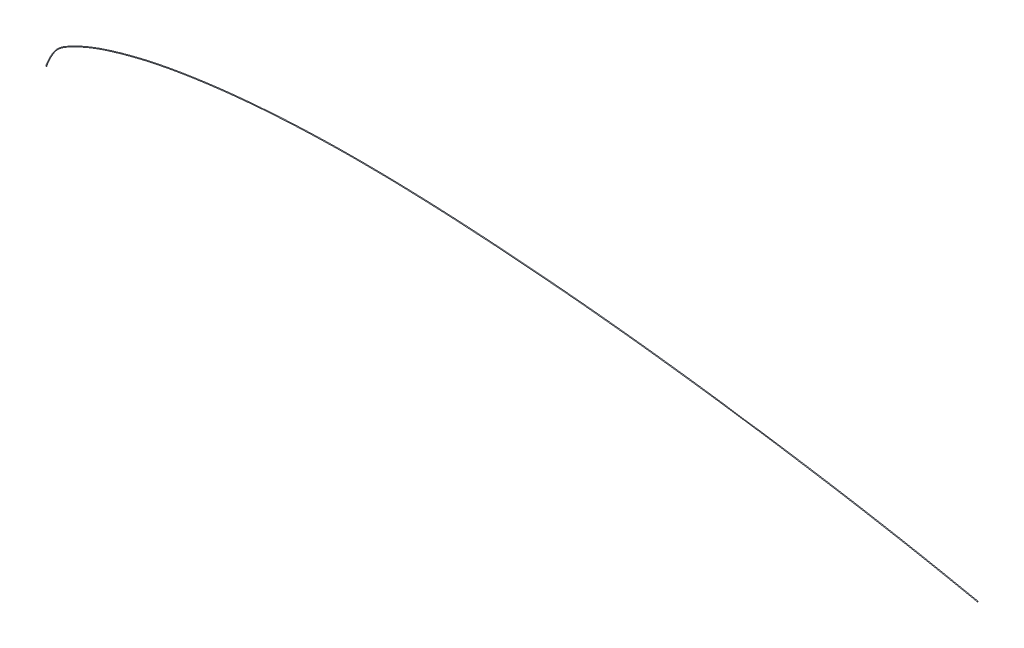
ISO-10303-21;
HEADER;
FILE_DESCRIPTION(('STEP AP214'),'2;1');
FILE_NAME('part.step','',(''),(''),'','','');
FILE_SCHEMA(('AUTOMOTIVE_DESIGN { 1 0 10303 214 1 1 1 1 }'));
ENDSEC;
DATA;
#1=APPLICATION_CONTEXT('core data for automotive mechanical design processes');
#2=APPLICATION_PROTOCOL_DEFINITION('international standard','automotive_design',2000,#1);
#3=PRODUCT_CONTEXT('',#1,'mechanical');
#4=PRODUCT('Part','Part','',(#3));
#5=PRODUCT_RELATED_PRODUCT_CATEGORY('part','',(#4));
#6=PRODUCT_DEFINITION_FORMATION('','',#4);
#7=PRODUCT_DEFINITION_CONTEXT('part definition',#1,'design');
#8=PRODUCT_DEFINITION('design','',#6,#7);
#9=PRODUCT_DEFINITION_SHAPE('','',#8);
#10=(LENGTH_UNIT() NAMED_UNIT(*) SI_UNIT(.MILLI.,.METRE.));
#11=(NAMED_UNIT(*) PLANE_ANGLE_UNIT() SI_UNIT($,.RADIAN.));
#12=(NAMED_UNIT(*) SI_UNIT($,.STERADIAN.) SOLID_ANGLE_UNIT());
#13=UNCERTAINTY_MEASURE_WITH_UNIT(LENGTH_MEASURE(1.E-05),#10,'distance_accuracy_value','');
#14=(GEOMETRIC_REPRESENTATION_CONTEXT(3) GLOBAL_UNCERTAINTY_ASSIGNED_CONTEXT((#13)) GLOBAL_UNIT_ASSIGNED_CONTEXT((#10,
#11,#12)) REPRESENTATION_CONTEXT('',''));
#15=CARTESIAN_POINT('',(0.,0.,0.));
#16=DIRECTION('',(0.,0.,1.));
#17=DIRECTION('',(1.,0.,0.));
#18=AXIS2_PLACEMENT_3D('',#15,#16,#17);
#19=CARTESIAN_POINT('',(1304.66,1.696058,0.));
#20=DIRECTION('',(0.98101772640487,0.193918076721638,0.));
#21=DIRECTION('',(0.,0.,1.));
#22=AXIS2_PLACEMENT_3D('',#19,#20,#21);
#23=PLANE('',#22);
#24=CARTESIAN_POINT('',(1304.66,1.696058,0.));
#25=DIRECTION('',(0.98101772640487,0.193918076721638,0.));
#26=DIRECTION('',(0.,0.,1.));
#27=AXIS2_PLACEMENT_3D('',#24,#25,#26);
#28=CIRCLE('',#27,0.5);
#29=CARTESIAN_POINT('',(1304.66,1.696058,0.5));
#30=VERTEX_POINT('',#29);
#31=EDGE_CURVE('E10',#30,#30,#28,.T.);
#32=ORIENTED_EDGE('',*,*,#31,.T.);
#33=EDGE_LOOP('',(#32));
#34=FACE_BOUND('',#33,.T.);
#35=ADVANCED_FACE('F36',(#34),#23,.T.);
#36=CARTESIAN_POINT('',(1304.66,1.696058,0.5));
#37=CARTESIAN_POINT('',(1282.92772693694,6.14929782340755,0.5));
#38=CARTESIAN_POINT('',(1261.195453882,10.6025376463355,0.5));
#39=CARTESIAN_POINT('',(1206.93838618714,21.2468164795281,0.5));
#40=CARTESIAN_POINT('',(1174.37031889667,27.2178116733628,0.5));
#41=CARTESIAN_POINT('',(1109.1263992094,38.5316321126376,0.5));
#42=CARTESIAN_POINT('',(1076.44825562522,43.8660900637924,0.5));
#43=CARTESIAN_POINT('',(1000.31155481095,55.6370762839409,0.5));
#44=CARTESIAN_POINT('',(956.820964703096,61.8638164249425,0.5));
#45=CARTESIAN_POINT('',(869.842521959019,73.2806504857611,0.5));
#46=CARTESIAN_POINT('',(826.355106530212,78.4740001523558,0.5));
#47=CARTESIAN_POINT('',(739.3698456084,87.4650095892404,0.5));
#48=CARTESIAN_POINT('',(695.872437072038,91.2668809355757,0.5));
#49=CARTESIAN_POINT('',(608.887227843404,97.6405842757081,0.5));
#50=CARTESIAN_POINT('',(565.399633056471,100.215211806732,0.5));
#51=CARTESIAN_POINT('',(478.395079739289,103.309375670061,0.5));
#52=CARTESIAN_POINT('',(434.878268327016,103.83205512042,0.5));
#53=CARTESIAN_POINT('',(347.826991695691,101.780222102428,0.5));
#54=CARTESIAN_POINT('',(304.279102157574,99.2352342375905,0.5));
#55=CARTESIAN_POINT('',(239.007528356002,92.4337100888985,0.5));
#56=CARTESIAN_POINT('',(217.137883231133,89.6354637061965,0.5));
#57=CARTESIAN_POINT('',(173.5760451149,82.7322944815344,0.5));
#58=CARTESIAN_POINT('',(151.884626005489,78.6259584178591,0.5));
#59=CARTESIAN_POINT('',(119.431730282466,70.7870655388134,0.5));
#60=CARTESIAN_POINT('',(108.469841313403,67.8385442853681,0.5));
#61=CARTESIAN_POINT('',(86.6531895763216,61.4142545774094,0.5));
#62=CARTESIAN_POINT('',(75.800572724708,57.9356519815337,0.5));
#63=CARTESIAN_POINT('',(58.4131300467896,51.2666959353052,0.5));
#64=CARTESIAN_POINT('',(51.711977333901,48.4116238929897,0.5));
#65=CARTESIAN_POINT('',(41.7677494726042,43.7114014230806,0.5));
#66=CARTESIAN_POINT('',(38.4709237202427,42.0750581987962,0.5));
#67=CARTESIAN_POINT('',(31.9013435093909,38.653392041473,0.5));
#68=CARTESIAN_POINT('',(28.5984661307997,36.8885624123483,0.5));
#69=CARTESIAN_POINT('',(22.2960932132934,33.0021250024146,0.5));
#70=CARTESIAN_POINT('',(19.3072364724937,30.8732794068314,0.5));
#71=CARTESIAN_POINT('',(14.0650864369098,25.9470099814017,0.5));
#72=CARTESIAN_POINT('',(11.8264044231569,23.1380015646142,0.5));
#73=CARTESIAN_POINT('',(5.88042116155558,14.0150452066754,0.5));
#74=CARTESIAN_POINT('',(2.94021057981981,7.00752260419467,0.5));
#75=CARTESIAN_POINT('',(0.,0.,0.5));
#76=CARTESIAN_POINT('',(1304.85391807672,0.71504027359513,0.5));
#77=CARTESIAN_POINT('',(1283.1216450112,5.16828009701831,0.5));
#78=CARTESIAN_POINT('',(1261.39211909736,9.62205097838318,0.5));
#79=CARTESIAN_POINT('',(1207.14871082492,20.2691492072442,0.5));
#80=CARTESIAN_POINT('',(1174.58755684666,26.2416707466145,0.5));
#81=CARTESIAN_POINT('',(1109.35648443649,37.5584393134051,0.5));
#82=CARTESIAN_POINT('',(1076.68427507403,42.8943254938844,0.5));
#83=CARTESIAN_POINT('',(1000.56025923444,54.6684681733289,0.5));
#84=CARTESIAN_POINT('',(957.077048031174,60.8971302794565,0.5));
#85=CARTESIAN_POINT('',(870.113621413838,72.3180677764635,0.5));
#86=CARTESIAN_POINT('',(826.635030147962,77.5139196283311,0.5));
#87=CARTESIAN_POINT('',(739.669980471018,86.5110545440057,0.5));
#88=CARTESIAN_POINT('',(696.182045583137,90.3159707432014,0.5));
#89=CARTESIAN_POINT('',(609.21456273342,96.6956297302292,0.5));
#90=CARTESIAN_POINT('',(565.738812751709,99.2743588163506,0.5));
#91=CARTESIAN_POINT('',(478.763648082635,102.379642465031,0.5));
#92=CARTESIAN_POINT('',(435.265134839953,102.909614172309,0.5));
#93=CARTESIAN_POINT('',(348.257218143032,100.877188017373,0.5));
#94=CARTESIAN_POINT('',(304.732401335284,98.3433407876192,0.5));
#95=CARTESIAN_POINT('',(239.501620102466,91.5641599649611,0.5));
#96=CARTESIAN_POINT('',(217.647362295906,88.7747488836073,0.5));
#97=CARTESIAN_POINT('',(174.119486365586,81.8926097012969,0.5));
#98=CARTESIAN_POINT('',(152.450377648477,77.8007095587956,0.5));
#99=CARTESIAN_POINT('',(120.038154950003,69.9917392674306,0.5));
#100=CARTESIAN_POINT('',(109.089130187921,67.0532199258716,0.5));
#101=CARTESIAN_POINT('',(87.2971444218757,60.6490257118598,0.5));
#102=CARTESIAN_POINT('',(76.4648666324215,57.1872347828332,0.5));
#103=CARTESIAN_POINT('',(59.12213099632,50.5610707814937,0.5));
#104=CARTESIAN_POINT('',(52.4386672790084,47.7241789003536,0.5));
#105=CARTESIAN_POINT('',(42.5201732156656,43.052597025368,0.5));
#106=CARTESIAN_POINT('',(39.2317929793971,41.4260249191439,0.5));
#107=CARTESIAN_POINT('',(32.6786929545262,38.0241909068752,0.5));
#108=CARTESIAN_POINT('',(29.3863151815706,36.2711388312426,0.5));
#109=CARTESIAN_POINT('',(23.1349025019732,32.4559409835558,0.5));
#110=CARTESIAN_POINT('',(20.1832806038605,30.3823821131525,0.5));
#111=CARTESIAN_POINT('',(15.0158859986617,25.6238789457748,0.5));
#112=CARTESIAN_POINT('',(12.7989611667208,22.8970651692601,0.5));
#113=CARTESIAN_POINT('',(6.88665507478732,13.9588208663837,0.5));
#114=CARTESIAN_POINT('',(3.94021057981981,7.00752260419594,0.5));
#115=CARTESIAN_POINT('',(1.,0.,0.5));
#116=CARTESIAN_POINT('',(1304.85391807672,0.71504027359513,-0.5));
#117=CARTESIAN_POINT('',(1283.1216450112,5.16828009701831,-0.5));
#118=CARTESIAN_POINT('',(1261.39211909736,9.62205097838318,-0.5));
#119=CARTESIAN_POINT('',(1207.14871082492,20.2691492072442,-0.5));
#120=CARTESIAN_POINT('',(1174.58755684666,26.2416707466145,-0.5));
#121=CARTESIAN_POINT('',(1109.35648443649,37.5584393134051,-0.5));
#122=CARTESIAN_POINT('',(1076.68427507403,42.8943254938844,-0.5));
#123=CARTESIAN_POINT('',(1000.56025923444,54.6684681733289,-0.5));
#124=CARTESIAN_POINT('',(957.077048031174,60.8971302794565,-0.5));
#125=CARTESIAN_POINT('',(870.113621413838,72.3180677764635,-0.5));
#126=CARTESIAN_POINT('',(826.635030147962,77.5139196283311,-0.5));
#127=CARTESIAN_POINT('',(739.669980471018,86.5110545440057,-0.5));
#128=CARTESIAN_POINT('',(696.182045583137,90.3159707432014,-0.5));
#129=CARTESIAN_POINT('',(609.21456273342,96.6956297302292,-0.5));
#130=CARTESIAN_POINT('',(565.738812751709,99.2743588163506,-0.5));
#131=CARTESIAN_POINT('',(478.763648082635,102.379642465031,-0.5));
#132=CARTESIAN_POINT('',(435.265134839953,102.909614172309,-0.5));
#133=CARTESIAN_POINT('',(348.257218143032,100.877188017373,-0.5));
#134=CARTESIAN_POINT('',(304.732401335284,98.3433407876192,-0.5));
#135=CARTESIAN_POINT('',(239.501620102466,91.5641599649611,-0.5));
#136=CARTESIAN_POINT('',(217.647362295906,88.7747488836073,-0.5));
#137=CARTESIAN_POINT('',(174.119486365586,81.8926097012969,-0.5));
#138=CARTESIAN_POINT('',(152.450377648477,77.8007095587956,-0.5));
#139=CARTESIAN_POINT('',(120.038154950003,69.9917392674306,-0.5));
#140=CARTESIAN_POINT('',(109.089130187921,67.0532199258716,-0.5));
#141=CARTESIAN_POINT('',(87.2971444218757,60.6490257118598,-0.5));
#142=CARTESIAN_POINT('',(76.4648666324215,57.1872347828332,-0.5));
#143=CARTESIAN_POINT('',(59.12213099632,50.5610707814937,-0.5));
#144=CARTESIAN_POINT('',(52.4386672790084,47.7241789003536,-0.5));
#145=CARTESIAN_POINT('',(42.5201732156656,43.052597025368,-0.5));
#146=CARTESIAN_POINT('',(39.2317929793971,41.4260249191439,-0.5));
#147=CARTESIAN_POINT('',(32.6786929545262,38.0241909068752,-0.5));
#148=CARTESIAN_POINT('',(29.3863151815706,36.2711388312426,-0.5));
#149=CARTESIAN_POINT('',(23.1349025019732,32.4559409835558,-0.5));
#150=CARTESIAN_POINT('',(20.1832806038605,30.3823821131525,-0.5));
#151=CARTESIAN_POINT('',(15.0158859986617,25.6238789457748,-0.5));
#152=CARTESIAN_POINT('',(12.7989611667208,22.8970651692601,-0.5));
#153=CARTESIAN_POINT('',(6.88665507478732,13.9588208663837,-0.5));
#154=CARTESIAN_POINT('',(3.94021057981981,7.00752260419594,-0.5));
#155=CARTESIAN_POINT('',(1.,0.,-0.5));
#156=CARTESIAN_POINT('',(1304.66,1.696058,-0.5));
#157=CARTESIAN_POINT('',(1282.92772693694,6.14929782340755,-0.5));
#158=CARTESIAN_POINT('',(1261.195453882,10.6025376463355,-0.5));
#159=CARTESIAN_POINT('',(1206.93838618714,21.2468164795281,-0.5));
#160=CARTESIAN_POINT('',(1174.37031889667,27.2178116733628,-0.5));
#161=CARTESIAN_POINT('',(1109.1263992094,38.5316321126376,-0.5));
#162=CARTESIAN_POINT('',(1076.44825562522,43.8660900637924,-0.5));
#163=CARTESIAN_POINT('',(1000.31155481095,55.6370762839409,-0.5));
#164=CARTESIAN_POINT('',(956.820964703096,61.8638164249425,-0.5));
#165=CARTESIAN_POINT('',(869.842521959019,73.2806504857611,-0.5));
#166=CARTESIAN_POINT('',(826.355106530212,78.4740001523558,-0.5));
#167=CARTESIAN_POINT('',(739.3698456084,87.4650095892404,-0.5));
#168=CARTESIAN_POINT('',(695.872437072038,91.2668809355757,-0.5));
#169=CARTESIAN_POINT('',(608.887227843404,97.6405842757081,-0.5));
#170=CARTESIAN_POINT('',(565.399633056471,100.215211806732,-0.5));
#171=CARTESIAN_POINT('',(478.395079739289,103.309375670061,-0.5));
#172=CARTESIAN_POINT('',(434.878268327016,103.83205512042,-0.5));
#173=CARTESIAN_POINT('',(347.826991695691,101.780222102428,-0.5));
#174=CARTESIAN_POINT('',(304.279102157574,99.2352342375905,-0.5));
#175=CARTESIAN_POINT('',(239.007528356002,92.4337100888985,-0.5));
#176=CARTESIAN_POINT('',(217.137883231133,89.6354637061965,-0.5));
#177=CARTESIAN_POINT('',(173.5760451149,82.7322944815344,-0.5));
#178=CARTESIAN_POINT('',(151.884626005489,78.6259584178591,-0.5));
#179=CARTESIAN_POINT('',(119.431730282466,70.7870655388134,-0.5));
#180=CARTESIAN_POINT('',(108.469841313403,67.8385442853681,-0.5));
#181=CARTESIAN_POINT('',(86.6531895763216,61.4142545774094,-0.5));
#182=CARTESIAN_POINT('',(75.800572724708,57.9356519815337,-0.5));
#183=CARTESIAN_POINT('',(58.4131300467896,51.2666959353052,-0.5));
#184=CARTESIAN_POINT('',(51.711977333901,48.4116238929897,-0.5));
#185=CARTESIAN_POINT('',(41.7677494726042,43.7114014230806,-0.5));
#186=CARTESIAN_POINT('',(38.4709237202427,42.0750581987962,-0.5));
#187=CARTESIAN_POINT('',(31.9013435093909,38.653392041473,-0.5));
#188=CARTESIAN_POINT('',(28.5984661307997,36.8885624123483,-0.5));
#189=CARTESIAN_POINT('',(22.2960932132934,33.0021250024146,-0.5));
#190=CARTESIAN_POINT('',(19.3072364724937,30.8732794068314,-0.5));
#191=CARTESIAN_POINT('',(14.0650864369098,25.9470099814017,-0.5));
#192=CARTESIAN_POINT('',(11.8264044231569,23.1380015646142,-0.5));
#193=CARTESIAN_POINT('',(5.88042116155558,14.0150452066754,-0.5));
#194=CARTESIAN_POINT('',(2.94021057981981,7.00752260419467,-0.5));
#195=CARTESIAN_POINT('',(0.,0.,-0.5));
#196=CARTESIAN_POINT('',(1304.46608192328,2.67707572640487,-0.5));
#197=CARTESIAN_POINT('',(1282.73380886268,7.13031554979678,-0.5));
#198=CARTESIAN_POINT('',(1260.99878866664,11.5830243142878,-0.5));
#199=CARTESIAN_POINT('',(1206.72806154937,22.2244837518121,-0.5));
#200=CARTESIAN_POINT('',(1174.15308094667,28.1939526001111,-0.5));
#201=CARTESIAN_POINT('',(1108.89631398231,39.5048249118702,-0.5));
#202=CARTESIAN_POINT('',(1076.2122361764,44.8378546337004,-0.5));
#203=CARTESIAN_POINT('',(1000.06285038746,56.605684394553,-0.5));
#204=CARTESIAN_POINT('',(956.564881375017,62.8305025704285,-0.5));
#205=CARTESIAN_POINT('',(869.5714225042,74.2432331950586,-0.5));
#206=CARTESIAN_POINT('',(826.075182912462,79.4340806763805,-0.5));
#207=CARTESIAN_POINT('',(739.069710745781,88.4189646344751,-0.5));
#208=CARTESIAN_POINT('',(695.562828560939,92.21779112795,-0.5));
#209=CARTESIAN_POINT('',(608.559892953388,98.5855388211869,-0.5));
#210=CARTESIAN_POINT('',(565.060453361233,101.156064797113,-0.5));
#211=CARTESIAN_POINT('',(478.026511395943,104.239108875092,-0.5));
#212=CARTESIAN_POINT('',(434.491401814078,104.754496068532,-0.5));
#213=CARTESIAN_POINT('',(347.39676524835,102.683256187484,-0.5));
#214=CARTESIAN_POINT('',(303.825802979864,100.127127687562,-0.5));
#215=CARTESIAN_POINT('',(238.513436609538,93.3032602128359,-0.5));
#216=CARTESIAN_POINT('',(216.62840416636,90.4961785287856,-0.5));
#217=CARTESIAN_POINT('',(173.032603864213,83.5719792617719,-0.5));
#218=CARTESIAN_POINT('',(151.3188743625,79.4512072769225,-0.5));
#219=CARTESIAN_POINT('',(118.825305614928,71.5823918101961,-0.5));
#220=CARTESIAN_POINT('',(107.850552438886,68.6238686448646,-0.5));
#221=CARTESIAN_POINT('',(86.0092347307675,62.1794834429589,-0.5));
#222=CARTESIAN_POINT('',(75.1362788169945,58.6840691802343,-0.5));
#223=CARTESIAN_POINT('',(57.7041290972591,51.9723210891166,-0.5));
#224=CARTESIAN_POINT('',(50.9852873887935,49.0990688856258,-0.5));
#225=CARTESIAN_POINT('',(41.0153257295429,44.3702058207931,-0.5));
#226=CARTESIAN_POINT('',(37.7100544610884,42.7240914784485,-0.5));
#227=CARTESIAN_POINT('',(31.1239940642555,39.2825931760708,-0.5));
#228=CARTESIAN_POINT('',(27.8106170800288,37.5059859934541,-0.5));
#229=CARTESIAN_POINT('',(21.4572839246135,33.5483090212734,-0.5));
#230=CARTESIAN_POINT('',(18.431192341127,31.3641767005103,-0.5));
#231=CARTESIAN_POINT('',(13.1142868751578,26.2701410170286,-0.5));
#232=CARTESIAN_POINT('',(10.8538476795929,23.3789379599684,-0.5));
#233=CARTESIAN_POINT('',(4.87418724832385,14.0712695469671,-0.5));
#234=CARTESIAN_POINT('',(1.94021057981981,7.00752260419341,-0.5));
#235=CARTESIAN_POINT('',(-1.,0.,-0.5));
#236=CARTESIAN_POINT('',(1304.46608192328,2.67707572640487,0.5));
#237=CARTESIAN_POINT('',(1282.73380886268,7.13031554979678,0.5));
#238=CARTESIAN_POINT('',(1260.99878866664,11.5830243142878,0.5));
#239=CARTESIAN_POINT('',(1206.72806154937,22.2244837518121,0.5));
#240=CARTESIAN_POINT('',(1174.15308094667,28.1939526001111,0.5));
#241=CARTESIAN_POINT('',(1108.89631398231,39.5048249118702,0.5));
#242=CARTESIAN_POINT('',(1076.2122361764,44.8378546337004,0.5));
#243=CARTESIAN_POINT('',(1000.06285038746,56.605684394553,0.5));
#244=CARTESIAN_POINT('',(956.564881375017,62.8305025704285,0.5));
#245=CARTESIAN_POINT('',(869.5714225042,74.2432331950586,0.5));
#246=CARTESIAN_POINT('',(826.075182912462,79.4340806763805,0.5));
#247=CARTESIAN_POINT('',(739.069710745781,88.4189646344751,0.5));
#248=CARTESIAN_POINT('',(695.562828560939,92.21779112795,0.5));
#249=CARTESIAN_POINT('',(608.559892953388,98.5855388211869,0.5));
#250=CARTESIAN_POINT('',(565.060453361233,101.156064797113,0.5));
#251=CARTESIAN_POINT('',(478.026511395943,104.239108875092,0.5));
#252=CARTESIAN_POINT('',(434.491401814078,104.754496068532,0.5));
#253=CARTESIAN_POINT('',(347.39676524835,102.683256187484,0.5));
#254=CARTESIAN_POINT('',(303.825802979864,100.127127687562,0.5));
#255=CARTESIAN_POINT('',(238.513436609538,93.3032602128359,0.5));
#256=CARTESIAN_POINT('',(216.62840416636,90.4961785287856,0.5));
#257=CARTESIAN_POINT('',(173.032603864213,83.5719792617719,0.5));
#258=CARTESIAN_POINT('',(151.3188743625,79.4512072769225,0.5));
#259=CARTESIAN_POINT('',(118.825305614928,71.5823918101961,0.5));
#260=CARTESIAN_POINT('',(107.850552438886,68.6238686448646,0.5));
#261=CARTESIAN_POINT('',(86.0092347307675,62.1794834429589,0.5));
#262=CARTESIAN_POINT('',(75.1362788169945,58.6840691802343,0.5));
#263=CARTESIAN_POINT('',(57.7041290972591,51.9723210891166,0.5));
#264=CARTESIAN_POINT('',(50.9852873887935,49.0990688856258,0.5));
#265=CARTESIAN_POINT('',(41.0153257295429,44.3702058207931,0.5));
#266=CARTESIAN_POINT('',(37.7100544610884,42.7240914784485,0.5));
#267=CARTESIAN_POINT('',(31.1239940642555,39.2825931760708,0.5));
#268=CARTESIAN_POINT('',(27.8106170800288,37.5059859934541,0.5));
#269=CARTESIAN_POINT('',(21.4572839246135,33.5483090212734,0.5));
#270=CARTESIAN_POINT('',(18.431192341127,31.3641767005103,0.5));
#271=CARTESIAN_POINT('',(13.1142868751578,26.2701410170286,0.5));
#272=CARTESIAN_POINT('',(10.8538476795929,23.3789379599684,0.5));
#273=CARTESIAN_POINT('',(4.87418724832385,14.0712695469671,0.5));
#274=CARTESIAN_POINT('',(1.94021057981981,7.00752260419341,0.5));
#275=CARTESIAN_POINT('',(-1.,0.,0.5));
#276=CARTESIAN_POINT('',(1304.66,1.696058,0.5));
#277=CARTESIAN_POINT('',(1282.92772693694,6.14929782340755,0.5));
#278=CARTESIAN_POINT('',(1261.195453882,10.6025376463355,0.5));
#279=CARTESIAN_POINT('',(1206.93838618714,21.2468164795281,0.5));
#280=CARTESIAN_POINT('',(1174.37031889667,27.2178116733628,0.5));
#281=CARTESIAN_POINT('',(1109.1263992094,38.5316321126376,0.5));
#282=CARTESIAN_POINT('',(1076.44825562522,43.8660900637924,0.5));
#283=CARTESIAN_POINT('',(1000.31155481095,55.6370762839409,0.5));
#284=CARTESIAN_POINT('',(956.820964703096,61.8638164249425,0.5));
#285=CARTESIAN_POINT('',(869.842521959019,73.2806504857611,0.5));
#286=CARTESIAN_POINT('',(826.355106530212,78.4740001523558,0.5));
#287=CARTESIAN_POINT('',(739.3698456084,87.4650095892404,0.5));
#288=CARTESIAN_POINT('',(695.872437072038,91.2668809355757,0.5));
#289=CARTESIAN_POINT('',(608.887227843404,97.6405842757081,0.5));
#290=CARTESIAN_POINT('',(565.399633056471,100.215211806732,0.5));
#291=CARTESIAN_POINT('',(478.395079739289,103.309375670061,0.5));
#292=CARTESIAN_POINT('',(434.878268327016,103.83205512042,0.5));
#293=CARTESIAN_POINT('',(347.826991695691,101.780222102428,0.5));
#294=CARTESIAN_POINT('',(304.279102157574,99.2352342375905,0.5));
#295=CARTESIAN_POINT('',(239.007528356002,92.4337100888985,0.5));
#296=CARTESIAN_POINT('',(217.137883231133,89.6354637061965,0.5));
#297=CARTESIAN_POINT('',(173.5760451149,82.7322944815344,0.5));
#298=CARTESIAN_POINT('',(151.884626005489,78.6259584178591,0.5));
#299=CARTESIAN_POINT('',(119.431730282466,70.7870655388134,0.5));
#300=CARTESIAN_POINT('',(108.469841313403,67.8385442853681,0.5));
#301=CARTESIAN_POINT('',(86.6531895763216,61.4142545774094,0.5));
#302=CARTESIAN_POINT('',(75.800572724708,57.9356519815337,0.5));
#303=CARTESIAN_POINT('',(58.4131300467896,51.2666959353052,0.5));
#304=CARTESIAN_POINT('',(51.711977333901,48.4116238929897,0.5));
#305=CARTESIAN_POINT('',(41.7677494726042,43.7114014230806,0.5));
#306=CARTESIAN_POINT('',(38.4709237202427,42.0750581987962,0.5));
#307=CARTESIAN_POINT('',(31.9013435093909,38.653392041473,0.5));
#308=CARTESIAN_POINT('',(28.5984661307997,36.8885624123483,0.5));
#309=CARTESIAN_POINT('',(22.2960932132934,33.0021250024146,0.5));
#310=CARTESIAN_POINT('',(19.3072364724937,30.8732794068314,0.5));
#311=CARTESIAN_POINT('',(14.0650864369098,25.9470099814017,0.5));
#312=CARTESIAN_POINT('',(11.8264044231569,23.1380015646142,0.5));
#313=CARTESIAN_POINT('',(5.88042116155558,14.0150452066754,0.5));
#314=CARTESIAN_POINT('',(2.94021057981981,7.00752260419467,0.5));
#315=CARTESIAN_POINT('',(0.,0.,0.5));
#316=(BOUNDED_SURFACE() B_SPLINE_SURFACE(3,3,((#36,#37,#38,#39,#40,#41,#42,#43,#44,#45,#46,#47,
#48,#49,#50,#51,#52,#53,#54,#55,#56,#57,#58,#59,#60,#61,#62,#63,#64,#65,#66,#67,#68,#69,#70,#71,
#72,#73,#74,#75),(#76,#77,#78,#79,#80,#81,#82,#83,#84,#85,#86,#87,#88,#89,#90,#91,#92,#93,#94,
#95,#96,#97,#98,#99,#100,#101,#102,#103,#104,#105,#106,#107,#108,#109,#110,#111,#112,#113,#114,
#115),(#116,#117,#118,#119,#120,#121,#122,#123,#124,#125,#126,#127,#128,#129,#130,#131,#132,
#133,#134,#135,#136,#137,#138,#139,#140,#141,#142,#143,#144,#145,#146,#147,#148,#149,#150,#151,
#152,#153,#154,#155),(#156,#157,#158,#159,#160,#161,#162,#163,#164,#165,#166,#167,#168,#169,
#170,#171,#172,#173,#174,#175,#176,#177,#178,#179,#180,#181,#182,#183,#184,#185,#186,#187,#188,
#189,#190,#191,#192,#193,#194,#195),(#196,#197,#198,#199,#200,#201,#202,#203,#204,#205,#206,
#207,#208,#209,#210,#211,#212,#213,#214,#215,#216,#217,#218,#219,#220,#221,#222,#223,#224,#225,
#226,#227,#228,#229,#230,#231,#232,#233,#234,#235),(#236,#237,#238,#239,#240,#241,#242,#243,
#244,#245,#246,#247,#248,#249,#250,#251,#252,#253,#254,#255,#256,#257,#258,#259,#260,#261,#262,
#263,#264,#265,#266,#267,#268,#269,#270,#271,#272,#273,#274,#275),(#276,#277,#278,#279,#280,
#281,#282,#283,#284,#285,#286,#287,#288,#289,#290,#291,#292,#293,#294,#295,#296,#297,#298,#299,
#300,#301,#302,#303,#304,#305,#306,#307,#308,#309,#310,#311,#312,#313,#314,#315)),.UNSPECIFIED.,
.T.,.F.,.F.) B_SPLINE_SURFACE_WITH_KNOTS((4,3,4),(4,2,2,2,2,2,2,2,2,2,2,2,2,2,2,2,2,2,2,4),(0.,
0.5,1.),(0.,0.0496812988513006,0.123828803347963,0.197976307844626,0.296362491062684,
0.394433617199178,0.492205408317245,0.589753408165242,0.687151928165724,0.784753711389578,
0.834119584128113,0.883485456866648,0.908917356863356,0.934349256860064,0.950761942645048,
0.95896828553754,0.967174628430032,0.975380971322524,0.983587314215016,1.),
.UNSPECIFIED.) GEOMETRIC_REPRESENTATION_ITEM() RATIONAL_B_SPLINE_SURFACE(((1.,1.,1.,1.,1.,1.,1.,
1.,1.,1.,1.,1.,1.,1.,1.,1.,1.,1.,1.,1.,1.,1.,1.,1.,1.,1.,1.,1.,1.,1.,1.,1.,1.,1.,1.,1.,1.,1.,1.,
1.),(0.333333333333333,0.333333333333333,0.333333333333333,0.333333333333333,0.333333333333333,
0.333333333333333,0.333333333333333,0.333333333333333,0.333333333333333,0.333333333333333,
0.333333333333333,0.333333333333333,0.333333333333333,0.333333333333333,0.333333333333333,
0.333333333333333,0.333333333333333,0.333333333333333,0.333333333333333,0.333333333333333,
0.333333333333333,0.333333333333333,0.333333333333333,0.333333333333333,0.333333333333333,
0.333333333333333,0.333333333333333,0.333333333333333,0.333333333333333,0.333333333333333,
0.333333333333333,0.333333333333333,0.333333333333333,0.333333333333333,0.333333333333333,
0.333333333333333,0.333333333333333,0.333333333333333,0.333333333333333,0.333333333333333),
(0.333333333333333,0.333333333333333,0.333333333333333,0.333333333333333,0.333333333333333,
0.333333333333333,0.333333333333333,0.333333333333333,0.333333333333333,0.333333333333333,
0.333333333333333,0.333333333333333,0.333333333333333,0.333333333333333,0.333333333333333,
0.333333333333333,0.333333333333333,0.333333333333333,0.333333333333333,0.333333333333333,
0.333333333333333,0.333333333333333,0.333333333333333,0.333333333333333,0.333333333333333,
0.333333333333333,0.333333333333333,0.333333333333333,0.333333333333333,0.333333333333333,
0.333333333333333,0.333333333333333,0.333333333333333,0.333333333333333,0.333333333333333,
0.333333333333333,0.333333333333333,0.333333333333333,0.333333333333333,0.333333333333333),(1.,
1.,1.,1.,1.,1.,1.,1.,1.,1.,1.,1.,1.,1.,1.,1.,1.,1.,1.,1.,1.,1.,1.,1.,1.,1.,1.,1.,1.,1.,1.,1.,1.,
1.,1.,1.,1.,1.,1.,1.),(0.333333333333333,0.333333333333333,0.333333333333333,0.333333333333333,
0.333333333333333,0.333333333333333,0.333333333333333,0.333333333333333,0.333333333333333,
0.333333333333333,0.333333333333333,0.333333333333333,0.333333333333333,0.333333333333333,
0.333333333333333,0.333333333333333,0.333333333333333,0.333333333333333,0.333333333333333,
0.333333333333333,0.333333333333333,0.333333333333333,0.333333333333333,0.333333333333333,
0.333333333333333,0.333333333333333,0.333333333333333,0.333333333333333,0.333333333333333,
0.333333333333333,0.333333333333333,0.333333333333333,0.333333333333333,0.333333333333333,
0.333333333333333,0.333333333333333,0.333333333333333,0.333333333333333,0.333333333333333,
0.333333333333333),(0.333333333333333,0.333333333333333,0.333333333333333,0.333333333333333,
0.333333333333333,0.333333333333333,0.333333333333333,0.333333333333333,0.333333333333333,
0.333333333333333,0.333333333333333,0.333333333333333,0.333333333333333,0.333333333333333,
0.333333333333333,0.333333333333333,0.333333333333333,0.333333333333333,0.333333333333333,
0.333333333333333,0.333333333333333,0.333333333333333,0.333333333333333,0.333333333333333,
0.333333333333333,0.333333333333333,0.333333333333333,0.333333333333333,0.333333333333333,
0.333333333333333,0.333333333333333,0.333333333333333,0.333333333333333,0.333333333333333,
0.333333333333333,0.333333333333333,0.333333333333333,0.333333333333333,0.333333333333333,
0.333333333333333),(1.,1.,1.,1.,1.,1.,1.,1.,1.,1.,1.,1.,1.,1.,1.,1.,1.,1.,1.,1.,1.,1.,1.,1.,1.,
1.,1.,1.,1.,1.,1.,1.,1.,1.,1.,1.,1.,1.,1.,1.))) REPRESENTATION_ITEM('') SURFACE());
#317=CARTESIAN_POINT('',(0.,0.,0.));
#318=DIRECTION('',(0.,1.,0.));
#319=DIRECTION('',(0.,0.,1.));
#320=AXIS2_PLACEMENT_3D('',#317,#318,#319);
#321=CIRCLE('',#320,0.5);
#322=CARTESIAN_POINT('',(0.,0.,0.5));
#323=VERTEX_POINT('',#322);
#324=EDGE_CURVE('E46',#323,#323,#321,.T.);
#325=ORIENTED_EDGE('',*,*,#324,.T.);
#326=EDGE_LOOP('',(#325));
#327=FACE_BOUND('',#326,.T.);
#328=ORIENTED_EDGE('',*,*,#31,.F.);
#329=EDGE_LOOP('',(#328));
#330=FACE_BOUND('',#329,.T.);
#331=ADVANCED_FACE('F53',(#327,#330),#316,.F.);
#332=CARTESIAN_POINT('',(0.,-1.,0.));
#333=DIRECTION('',(0.,1.,0.));
#334=DIRECTION('',(0.,0.,1.));
#335=AXIS2_PLACEMENT_3D('',#332,#333,#334);
#336=CYLINDRICAL_SURFACE('',#335,0.5);
#337=CARTESIAN_POINT('',(0.,-1.,0.));
#338=DIRECTION('',(0.,1.,0.));
#339=DIRECTION('',(0.,0.,1.));
#340=AXIS2_PLACEMENT_3D('',#337,#338,#339);
#341=CIRCLE('',#340,0.5);
#342=CARTESIAN_POINT('',(0.,-1.,0.5));
#343=VERTEX_POINT('',#342);
#344=EDGE_CURVE('E42',#343,#343,#341,.T.);
#345=ORIENTED_EDGE('',*,*,#344,.T.);
#346=EDGE_LOOP('',(#345));
#347=FACE_BOUND('',#346,.T.);
#348=ORIENTED_EDGE('',*,*,#324,.F.);
#349=EDGE_LOOP('',(#348));
#350=FACE_BOUND('',#349,.T.);
#351=ADVANCED_FACE('F56',(#347,#350),#336,.T.);
#352=CARTESIAN_POINT('',(0.,-1.,0.));
#353=DIRECTION('',(0.,1.,0.));
#354=DIRECTION('',(0.,0.,1.));
#355=AXIS2_PLACEMENT_3D('',#352,#353,#354);
#356=PLANE('',#355);
#357=ORIENTED_EDGE('',*,*,#344,.F.);
#358=EDGE_LOOP('',(#357));
#359=FACE_BOUND('',#358,.T.);
#360=ADVANCED_FACE('F58',(#359),#356,.F.);
#361=CLOSED_SHELL('',(#35,#331,#351,#360));
#362=MANIFOLD_SOLID_BREP('B2',#361);
#363=ADVANCED_BREP_SHAPE_REPRESENTATION('',(#18,#362),#14);
#364=SHAPE_DEFINITION_REPRESENTATION(#9,#363);
ENDSEC;
END-ISO-10303-21;
